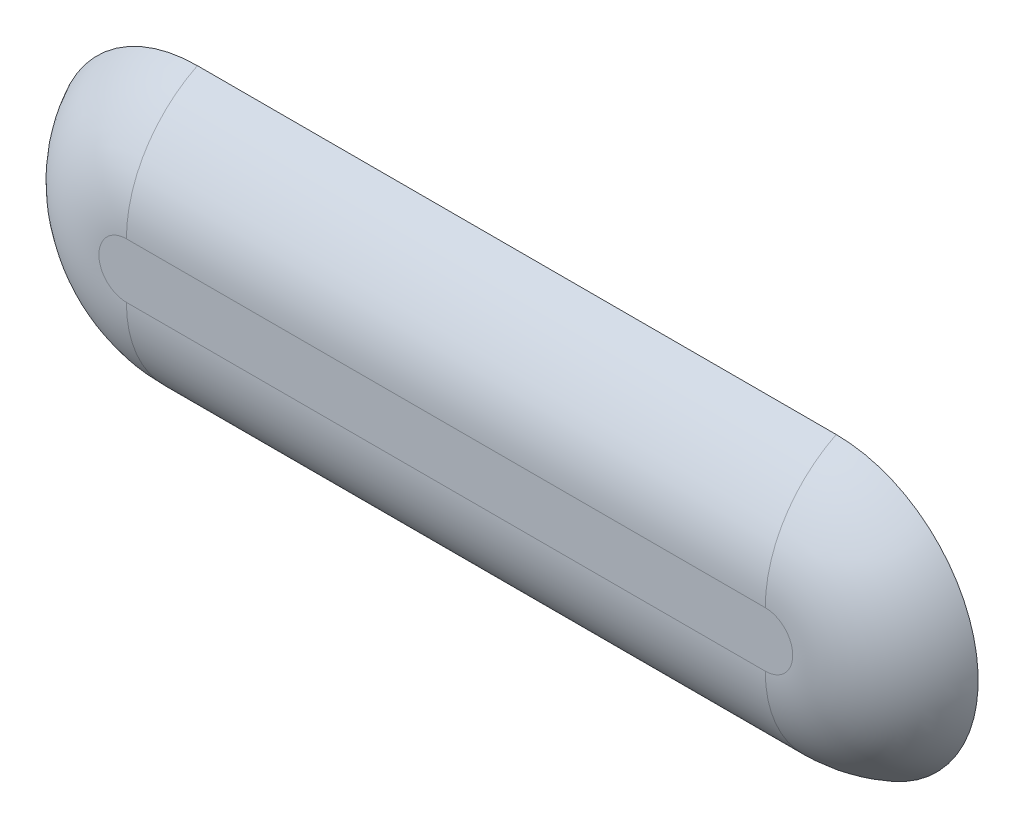
ISO-10303-21;
HEADER;
FILE_DESCRIPTION(('STEP AP214'),'2;1');
FILE_NAME('part.step','',(''),(''),'','','');
FILE_SCHEMA(('AUTOMOTIVE_DESIGN { 1 0 10303 214 1 1 1 1 }'));
ENDSEC;
DATA;
#1=APPLICATION_CONTEXT('core data for automotive mechanical design processes');
#2=APPLICATION_PROTOCOL_DEFINITION('international standard','automotive_design',2000,#1);
#3=PRODUCT_CONTEXT('',#1,'mechanical');
#4=PRODUCT('Part','Part','',(#3));
#5=PRODUCT_RELATED_PRODUCT_CATEGORY('part','',(#4));
#6=PRODUCT_DEFINITION_FORMATION('','',#4);
#7=PRODUCT_DEFINITION_CONTEXT('part definition',#1,'design');
#8=PRODUCT_DEFINITION('design','',#6,#7);
#9=PRODUCT_DEFINITION_SHAPE('','',#8);
#10=(LENGTH_UNIT() NAMED_UNIT(*) SI_UNIT(.MILLI.,.METRE.));
#11=(NAMED_UNIT(*) PLANE_ANGLE_UNIT() SI_UNIT($,.RADIAN.));
#12=(NAMED_UNIT(*) SI_UNIT($,.STERADIAN.) SOLID_ANGLE_UNIT());
#13=UNCERTAINTY_MEASURE_WITH_UNIT(LENGTH_MEASURE(1.E-05),#10,'distance_accuracy_value','');
#14=(GEOMETRIC_REPRESENTATION_CONTEXT(3) GLOBAL_UNCERTAINTY_ASSIGNED_CONTEXT((#13)) GLOBAL_UNIT_ASSIGNED_CONTEXT((#10,
#11,#12)) REPRESENTATION_CONTEXT('',''));
#15=CARTESIAN_POINT('',(0.,0.,0.));
#16=DIRECTION('',(0.,0.,1.));
#17=DIRECTION('',(1.,0.,0.));
#18=AXIS2_PLACEMENT_3D('',#15,#16,#17);
#19=CARTESIAN_POINT('',(0.,0.,0.254));
#20=DIRECTION('',(0.,0.,1.));
#21=DIRECTION('',(1.,0.,0.));
#22=AXIS2_PLACEMENT_3D('',#19,#20,#21);
#23=PLANE('',#22);
#24=DIRECTION('',(1.,0.,0.));
#25=VECTOR('',#24,1.);
#26=CARTESIAN_POINT('',(0.,0.0984373063864337,0.254));
#27=LINE('',#26,#25);
#28=CARTESIAN_POINT('',(2.286,0.0984373063864337,0.254));
#29=VERTEX_POINT('',#28);
#30=CARTESIAN_POINT('',(0.,0.0984373063864337,0.254));
#31=VERTEX_POINT('',#30);
#32=EDGE_CURVE('E116',#29,#31,#27,.F.);
#33=ORIENTED_EDGE('',*,*,#32,.T.);
#34=CARTESIAN_POINT('',(0.,0.,0.254));
#35=DIRECTION('',(0.,0.,1.));
#36=DIRECTION('',(1.,0.,0.));
#37=AXIS2_PLACEMENT_3D('',#34,#35,#36);
#38=CIRCLE('',#37,0.0984373063864337);
#39=CARTESIAN_POINT('',(0.,-0.0984373063864337,0.254));
#40=VERTEX_POINT('',#39);
#41=EDGE_CURVE('E11',#31,#40,#38,.T.);
#42=ORIENTED_EDGE('',*,*,#41,.T.);
#43=DIRECTION('',(-1.,0.,0.));
#44=VECTOR('',#43,1.);
#45=CARTESIAN_POINT('',(2.286,-0.0984373063864337,0.254));
#46=LINE('',#45,#44);
#47=CARTESIAN_POINT('',(2.286,-0.0984373063864337,0.254));
#48=VERTEX_POINT('',#47);
#49=EDGE_CURVE('E51',#40,#48,#46,.F.);
#50=ORIENTED_EDGE('',*,*,#49,.T.);
#51=CARTESIAN_POINT('',(2.286,0.,0.254));
#52=DIRECTION('',(0.,0.,1.));
#53=DIRECTION('',(1.,0.,0.));
#54=AXIS2_PLACEMENT_3D('',#51,#52,#53);
#55=CIRCLE('',#54,0.0984373063864337);
#56=EDGE_CURVE('E118',#48,#29,#55,.T.);
#57=ORIENTED_EDGE('',*,*,#56,.T.);
#58=EDGE_LOOP('',(#33,#42,#50,#57));
#59=FACE_BOUND('',#58,.T.);
#60=ADVANCED_FACE('F41',(#59),#23,.T.);
#61=CARTESIAN_POINT('',(0.,0.,0.));
#62=DIRECTION('',(0.,0.,1.));
#63=DIRECTION('',(1.,0.,0.));
#64=AXIS2_PLACEMENT_3D('',#61,#62,#63);
#65=PLANE('',#64);
#66=CARTESIAN_POINT('',(0.,0.,0.));
#67=DIRECTION('',(0.,0.,1.));
#68=DIRECTION('',(1.,0.,0.));
#69=AXIS2_PLACEMENT_3D('',#66,#67,#68);
#70=CIRCLE('',#69,0.508);
#71=CARTESIAN_POINT('',(0.,0.508,0.));
#72=VERTEX_POINT('',#71);
#73=CARTESIAN_POINT('',(0.,-0.508,0.));
#74=VERTEX_POINT('',#73);
#75=EDGE_CURVE('E87',#72,#74,#70,.T.);
#76=ORIENTED_EDGE('',*,*,#75,.F.);
#77=DIRECTION('',(-1.,0.,0.));
#78=VECTOR('',#77,1.);
#79=CARTESIAN_POINT('',(0.,0.508,0.));
#80=LINE('',#79,#78);
#81=CARTESIAN_POINT('',(2.286,0.508,0.));
#82=VERTEX_POINT('',#81);
#83=EDGE_CURVE('E115',#82,#72,#80,.T.);
#84=ORIENTED_EDGE('',*,*,#83,.F.);
#85=CARTESIAN_POINT('',(2.286,0.,0.));
#86=DIRECTION('',(0.,0.,1.));
#87=DIRECTION('',(1.,0.,0.));
#88=AXIS2_PLACEMENT_3D('',#85,#86,#87);
#89=CIRCLE('',#88,0.508);
#90=CARTESIAN_POINT('',(2.286,-0.508,0.));
#91=VERTEX_POINT('',#90);
#92=EDGE_CURVE('E89',#91,#82,#89,.T.);
#93=ORIENTED_EDGE('',*,*,#92,.F.);
#94=DIRECTION('',(1.,0.,0.));
#95=VECTOR('',#94,1.);
#96=CARTESIAN_POINT('',(0.,-0.508,0.));
#97=LINE('',#96,#95);
#98=EDGE_CURVE('E85',#74,#91,#97,.T.);
#99=ORIENTED_EDGE('',*,*,#98,.F.);
#100=EDGE_LOOP('',(#76,#84,#93,#99));
#101=FACE_BOUND('',#100,.T.);
#102=ADVANCED_FACE('F86',(#101),#65,.F.);
#103=CARTESIAN_POINT('',(2.286,0.,-0.2032));
#104=DIRECTION('',(0.,0.,-1.));
#105=DIRECTION('',(-1.,0.,0.));
#106=AXIS2_PLACEMENT_3D('',#103,#104,#105);
#107=DEGENERATE_TOROIDAL_SURFACE('',#106,0.0984373063864337,0.4572,.T.);
#108=CARTESIAN_POINT('',(2.286,-0.0984373063864331,-0.2032));
#109=DIRECTION('',(-1.,0.,0.));
#110=DIRECTION('',(0.,0.,1.));
#111=AXIS2_PLACEMENT_3D('',#108,#109,#110);
#112=CIRCLE('',#111,0.4572);
#113=EDGE_CURVE('E105',#91,#48,#112,.T.);
#114=ORIENTED_EDGE('',*,*,#113,.F.);
#115=ORIENTED_EDGE('',*,*,#92,.T.);
#116=CARTESIAN_POINT('',(2.286,0.0984373063864337,-0.2032));
#117=DIRECTION('',(-1.,0.,0.));
#118=DIRECTION('',(0.,0.,1.));
#119=AXIS2_PLACEMENT_3D('',#116,#117,#118);
#120=CIRCLE('',#119,0.4572);
#121=EDGE_CURVE('E45',#29,#82,#120,.T.);
#122=ORIENTED_EDGE('',*,*,#121,.F.);
#123=ORIENTED_EDGE('',*,*,#56,.F.);
#124=EDGE_LOOP('',(#114,#115,#122,#123));
#125=FACE_BOUND('',#124,.T.);
#126=ADVANCED_FACE('F43',(#125),#107,.T.);
#127=CARTESIAN_POINT('',(0.,0.0984373063864337,-0.2032));
#128=DIRECTION('',(-1.,0.,0.));
#129=DIRECTION('',(0.,0.,1.));
#130=AXIS2_PLACEMENT_3D('',#127,#128,#129);
#131=CYLINDRICAL_SURFACE('',#130,0.4572);
#132=ORIENTED_EDGE('',*,*,#121,.T.);
#133=ORIENTED_EDGE('',*,*,#83,.T.);
#134=CARTESIAN_POINT('',(0.,0.0984373063864337,-0.2032));
#135=DIRECTION('',(-1.,0.,0.));
#136=DIRECTION('',(0.,0.,1.));
#137=AXIS2_PLACEMENT_3D('',#134,#135,#136);
#138=CIRCLE('',#137,0.4572);
#139=EDGE_CURVE('E97',#31,#72,#138,.T.);
#140=ORIENTED_EDGE('',*,*,#139,.F.);
#141=ORIENTED_EDGE('',*,*,#32,.F.);
#142=EDGE_LOOP('',(#132,#133,#140,#141));
#143=FACE_BOUND('',#142,.T.);
#144=ADVANCED_FACE('F114',(#143),#131,.T.);
#145=CARTESIAN_POINT('',(0.,-0.0984373063864337,-0.2032));
#146=DIRECTION('',(1.,0.,0.));
#147=DIRECTION('',(0.,0.,-1.));
#148=AXIS2_PLACEMENT_3D('',#145,#146,#147);
#149=CYLINDRICAL_SURFACE('',#148,0.4572);
#150=ORIENTED_EDGE('',*,*,#113,.T.);
#151=ORIENTED_EDGE('',*,*,#49,.F.);
#152=CARTESIAN_POINT('',(0.,-0.0984373063864331,-0.2032));
#153=DIRECTION('',(-1.,0.,0.));
#154=DIRECTION('',(0.,0.,1.));
#155=AXIS2_PLACEMENT_3D('',#152,#153,#154);
#156=CIRCLE('',#155,0.4572);
#157=EDGE_CURVE('E59',#74,#40,#156,.T.);
#158=ORIENTED_EDGE('',*,*,#157,.F.);
#159=ORIENTED_EDGE('',*,*,#98,.T.);
#160=EDGE_LOOP('',(#150,#151,#158,#159));
#161=FACE_BOUND('',#160,.T.);
#162=ADVANCED_FACE('F101',(#161),#149,.T.);
#163=CARTESIAN_POINT('',(0.,0.,-0.2032));
#164=DIRECTION('',(0.,0.,-1.));
#165=DIRECTION('',(-1.,0.,0.));
#166=AXIS2_PLACEMENT_3D('',#163,#164,#165);
#167=DEGENERATE_TOROIDAL_SURFACE('',#166,0.0984373063864337,0.4572,.T.);
#168=ORIENTED_EDGE('',*,*,#139,.T.);
#169=ORIENTED_EDGE('',*,*,#75,.T.);
#170=ORIENTED_EDGE('',*,*,#157,.T.);
#171=ORIENTED_EDGE('',*,*,#41,.F.);
#172=EDGE_LOOP('',(#168,#169,#170,#171));
#173=FACE_BOUND('',#172,.T.);
#174=ADVANCED_FACE('F95',(#173),#167,.T.);
#175=CLOSED_SHELL('',(#60,#102,#126,#144,#162,#174));
#176=MANIFOLD_SOLID_BREP('B2',#175);
#177=ADVANCED_BREP_SHAPE_REPRESENTATION('',(#18,#176),#14);
#178=SHAPE_DEFINITION_REPRESENTATION(#9,#177);
ENDSEC;
END-ISO-10303-21;
